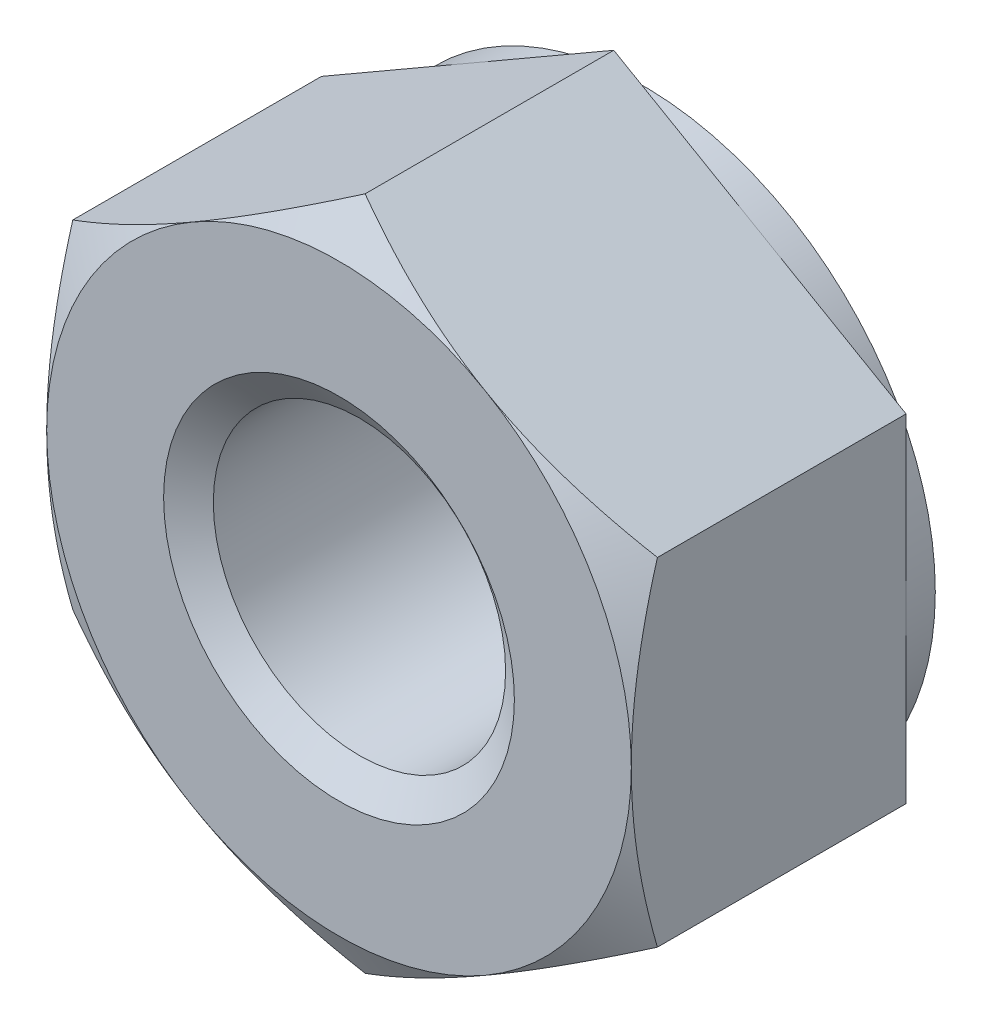
ISO-10303-21;
HEADER;
FILE_DESCRIPTION(('STEP AP214'),'2;1');
FILE_NAME('part.step','',(''),(''),'','','');
FILE_SCHEMA(('AUTOMOTIVE_DESIGN { 1 0 10303 214 1 1 1 1 }'));
ENDSEC;
DATA;
#1=APPLICATION_CONTEXT('core data for automotive mechanical design processes');
#2=APPLICATION_PROTOCOL_DEFINITION('international standard','automotive_design',2000,#1);
#3=PRODUCT_CONTEXT('',#1,'mechanical');
#4=PRODUCT('Part','Part','',(#3));
#5=PRODUCT_RELATED_PRODUCT_CATEGORY('part','',(#4));
#6=PRODUCT_DEFINITION_FORMATION('','',#4);
#7=PRODUCT_DEFINITION_CONTEXT('part definition',#1,'design');
#8=PRODUCT_DEFINITION('design','',#6,#7);
#9=PRODUCT_DEFINITION_SHAPE('','',#8);
#10=(LENGTH_UNIT() NAMED_UNIT(*) SI_UNIT(.MILLI.,.METRE.));
#11=(NAMED_UNIT(*) PLANE_ANGLE_UNIT() SI_UNIT($,.RADIAN.));
#12=(NAMED_UNIT(*) SI_UNIT($,.STERADIAN.) SOLID_ANGLE_UNIT());
#13=UNCERTAINTY_MEASURE_WITH_UNIT(LENGTH_MEASURE(1.E-05),#10,'distance_accuracy_value','');
#14=(GEOMETRIC_REPRESENTATION_CONTEXT(3) GLOBAL_UNCERTAINTY_ASSIGNED_CONTEXT((#13)) GLOBAL_UNIT_ASSIGNED_CONTEXT((#10,
#11,#12)) REPRESENTATION_CONTEXT('',''));
#15=CARTESIAN_POINT('',(0.,0.,0.));
#16=DIRECTION('',(0.,0.,1.));
#17=DIRECTION('',(1.,0.,0.));
#18=AXIS2_PLACEMENT_3D('',#15,#16,#17);
#19=CARTESIAN_POINT('',(0.,0.,-5.2));
#20=DIRECTION('',(0.,0.,1.));
#21=DIRECTION('',(1.,0.,0.));
#22=AXIS2_PLACEMENT_3D('',#19,#20,#21);
#23=CYLINDRICAL_SURFACE('',#22,2.5);
#24=CARTESIAN_POINT('',(0.,0.,-0.350103769104859));
#25=DIRECTION('',(0.,0.,1.));
#26=DIRECTION('',(1.,0.,0.));
#27=AXIS2_PLACEMENT_3D('',#24,#25,#26);
#28=CIRCLE('',#27,2.5);
#29=CARTESIAN_POINT('',(2.5,0.,-0.350103769104859));
#30=VERTEX_POINT('',#29);
#31=EDGE_CURVE('E153',#30,#30,#28,.F.);
#32=ORIENTED_EDGE('',*,*,#31,.F.);
#33=EDGE_LOOP('',(#32));
#34=FACE_BOUND('',#33,.T.);
#35=CARTESIAN_POINT('',(0.,0.,-4.82449623089514));
#36=DIRECTION('',(0.,0.,-1.));
#37=DIRECTION('',(-1.,0.,0.));
#38=AXIS2_PLACEMENT_3D('',#35,#36,#37);
#39=CIRCLE('',#38,2.5);
#40=CARTESIAN_POINT('',(-2.5,0.,-4.82449623089514));
#41=VERTEX_POINT('',#40);
#42=EDGE_CURVE('E41',#41,#41,#39,.F.);
#43=ORIENTED_EDGE('',*,*,#42,.F.);
#44=EDGE_LOOP('',(#43));
#45=FACE_BOUND('',#44,.T.);
#46=ADVANCED_FACE('F36',(#34,#45),#23,.F.);
#47=CARTESIAN_POINT('',(0.,5.77350269189626,-5.2));
#48=DIRECTION('',(-0.500000000000001,0.866025403784438,0.));
#49=DIRECTION('',(-0.866025403784438,-0.500000000000001,0.));
#50=AXIS2_PLACEMENT_3D('',#47,#48,#49);
#51=PLANE('',#50);
#52=DIRECTION('',(0.,0.,1.));
#53=VECTOR('',#52,1.);
#54=CARTESIAN_POINT('',(-5.,2.88675134594813,-5.2));
#55=LINE('',#54,#53);
#56=CARTESIAN_POINT('',(-5.,2.88675134594813,-4.7));
#57=VERTEX_POINT('',#56);
#58=CARTESIAN_POINT('',(-5.,2.88675134594813,-0.446581987385207));
#59=VERTEX_POINT('',#58);
#60=EDGE_CURVE('E291',#57,#59,#55,.T.);
#61=ORIENTED_EDGE('',*,*,#60,.T.);
#62=CARTESIAN_POINT('',(-5.0002,2.88663587589429,-0.44664865605183));
#63=CARTESIAN_POINT('',(-4.78046540547482,3.01349970319368,-0.373386567637636));
#64=CARTESIAN_POINT('',(-4.55885141554042,3.14144859993849,-0.306751321918093));
#65=CARTESIAN_POINT('',(-4.11178600454649,3.39956193532121,-0.190438991010811));
#66=CARTESIAN_POINT('',(-3.88632664040923,3.52973095989718,-0.140803049915789));
#67=CARTESIAN_POINT('',(-3.43816769477649,3.78847564779797,-0.0635510254186979));
#68=CARTESIAN_POINT('',(-3.21553790689581,3.91701101576052,-0.0354203782834897));
#69=CARTESIAN_POINT('',(-2.88081009815336,4.11026620624322,-0.0101949219536846));
#70=CARTESIAN_POINT('',(-2.76915780319494,4.17472868879311,-0.00461345976948387));
#71=CARTESIAN_POINT('',(-2.5457500293262,4.30371322717528,0.000797783248529765));
#72=CARTESIAN_POINT('',(-2.43399455370969,4.36823528110589,0.000627741741796264));
#73=CARTESIAN_POINT('',(-2.12781576914936,4.54500768479194,-0.00775363179203762));
#74=CARTESIAN_POINT('',(-1.93349391403279,4.65719946015293,-0.0218297718972529));
#75=CARTESIAN_POINT('',(-1.54613989800229,4.88083840557981,-0.0664652571094327));
#76=CARTESIAN_POINT('',(-1.35310909862843,4.99228478956021,-0.0970398601475102));
#77=CARTESIAN_POINT('',(-0.964974657525146,5.21637431361295,-0.173468493621167));
#78=CARTESIAN_POINT('',(-0.769920001358264,5.32898917185759,-0.219646378878684));
#79=CARTESIAN_POINT('',(-0.382719654641232,5.55253939626499,-0.324451794491939));
#80=CARTESIAN_POINT('',(-0.190569004591914,5.66347762579592,-0.383054703437379));
#81=CARTESIAN_POINT('',(0.000199999999999389,5.7736181619501,-0.446648656051834));
#82=B_SPLINE_CURVE_WITH_KNOTS('',3,(#62,#63,#64,#65,#66,#67,#68,#69,#70,#71,#72,#73,#74,#75,#76,
#77,#78,#79,#80,#81),.UNSPECIFIED.,.F.,.F.,(4,2,2,2,2,2,2,2,2,4),(0.,0.792555841363091,
1.58701660053334,2.36181537487281,2.74884076077326,3.13585419177295,3.8096236259968,
4.4840172390119,5.17336882348929,5.86136694793726),.UNSPECIFIED.);
#83=CARTESIAN_POINT('',(-2.50000000000001,4.33012701892219,0.));
#84=VERTEX_POINT('',#83);
#85=EDGE_CURVE('E139',#59,#84,#82,.T.);
#86=ORIENTED_EDGE('',*,*,#85,.T.);
#87=CARTESIAN_POINT('',(0.,5.77350269189626,-0.446581987385207));
#88=VERTEX_POINT('',#87);
#89=EDGE_CURVE('E166',#84,#88,#82,.T.);
#90=ORIENTED_EDGE('',*,*,#89,.T.);
#91=DIRECTION('',(0.,0.,1.));
#92=VECTOR('',#91,1.);
#93=CARTESIAN_POINT('',(0.,5.77350269189626,-5.2));
#94=LINE('',#93,#92);
#95=CARTESIAN_POINT('',(0.,5.77350269189626,-4.7));
#96=VERTEX_POINT('',#95);
#97=EDGE_CURVE('E279',#96,#88,#94,.T.);
#98=ORIENTED_EDGE('',*,*,#97,.F.);
#99=DIRECTION('',(-0.866025403784438,-0.500000000000001,0.));
#100=VECTOR('',#99,1.);
#101=CARTESIAN_POINT('',(0.,5.77350269189626,-4.7));
#102=LINE('',#101,#100);
#103=CARTESIAN_POINT('',(-2.50000000000001,4.33012701892219,-4.7));
#104=VERTEX_POINT('',#103);
#105=EDGE_CURVE('E267',#96,#104,#102,.T.);
#106=ORIENTED_EDGE('',*,*,#105,.T.);
#107=EDGE_CURVE('E263',#104,#57,#102,.T.);
#108=ORIENTED_EDGE('',*,*,#107,.T.);
#109=EDGE_LOOP('',(#61,#86,#90,#98,#106,#108));
#110=FACE_BOUND('',#109,.T.);
#111=ADVANCED_FACE('F38',(#110),#51,.T.);
#112=CARTESIAN_POINT('',(5.,2.88675134594812,-5.2));
#113=DIRECTION('',(0.500000000000001,0.866025403784438,0.));
#114=DIRECTION('',(-0.866025403784438,0.500000000000001,0.));
#115=AXIS2_PLACEMENT_3D('',#112,#113,#114);
#116=PLANE('',#115);
#117=ORIENTED_EDGE('',*,*,#97,.T.);
#118=CARTESIAN_POINT('',(-0.000200000000000168,5.7736181619501,-0.446648656051834));
#119=CARTESIAN_POINT('',(0.219534594525185,5.64675433465071,-0.373386567637639));
#120=CARTESIAN_POINT('',(0.44114858445958,5.5188054379059,-0.306751321918095));
#121=CARTESIAN_POINT('',(0.888213995453513,5.26069210252318,-0.190438991010813));
#122=CARTESIAN_POINT('',(1.11367335959077,5.13052307794721,-0.140803049915791));
#123=CARTESIAN_POINT('',(1.56183230522351,4.87177839004641,-0.0635510254186989));
#124=CARTESIAN_POINT('',(1.78446209310419,4.74324302208387,-0.03542037828349));
#125=CARTESIAN_POINT('',(2.11918990184664,4.54998783160116,-0.0101949219536847));
#126=CARTESIAN_POINT('',(2.23084219680506,4.48552534905128,-0.00461345976948397));
#127=CARTESIAN_POINT('',(2.4542499706738,4.35654081066911,0.000797783248529857));
#128=CARTESIAN_POINT('',(2.56600544629032,4.2920187567385,0.000627741741796628));
#129=CARTESIAN_POINT('',(2.87218423085064,4.11524635305244,-0.00775363179203654));
#130=CARTESIAN_POINT('',(3.06650608596722,4.00305457769146,-0.0218297718972514));
#131=CARTESIAN_POINT('',(3.45386010199771,3.77941563226457,-0.0664652571094306));
#132=CARTESIAN_POINT('',(3.64689090137157,3.66796924828418,-0.0970398601475081));
#133=CARTESIAN_POINT('',(4.03502534247485,3.44387972423143,-0.173468493621164));
#134=CARTESIAN_POINT('',(4.23007999864174,3.3312648659868,-0.21964637887868));
#135=CARTESIAN_POINT('',(4.61728034535877,3.1077146415794,-0.324451794491934));
#136=CARTESIAN_POINT('',(4.80943099540809,2.99677641204846,-0.383054703437375));
#137=CARTESIAN_POINT('',(5.0002,2.88663587589429,-0.446648656051829));
#138=B_SPLINE_CURVE_WITH_KNOTS('',3,(#118,#119,#120,#121,#122,#123,#124,#125,#126,#127,#128,
#129,#130,#131,#132,#133,#134,#135,#136,#137),.UNSPECIFIED.,.F.,.F.,(4,2,2,2,2,2,2,2,2,4),(0.,
0.792555841363093,1.58701660053334,2.36181537487281,2.74884076077326,3.13585419177296,
3.8096236259968,4.4840172390119,5.17336882348929,5.86136694793726),.UNSPECIFIED.);
#139=CARTESIAN_POINT('',(2.50000000000001,4.33012701892219,0.));
#140=VERTEX_POINT('',#139);
#141=EDGE_CURVE('E162',#88,#140,#138,.T.);
#142=ORIENTED_EDGE('',*,*,#141,.T.);
#143=CARTESIAN_POINT('',(5.,2.88675134594814,-0.446581987385207));
#144=VERTEX_POINT('',#143);
#145=EDGE_CURVE('E148',#140,#144,#138,.T.);
#146=ORIENTED_EDGE('',*,*,#145,.T.);
#147=DIRECTION('',(0.,0.,1.));
#148=VECTOR('',#147,1.);
#149=CARTESIAN_POINT('',(5.,2.88675134594812,-5.2));
#150=LINE('',#149,#148);
#151=CARTESIAN_POINT('',(5.,2.88675134594812,-4.7));
#152=VERTEX_POINT('',#151);
#153=EDGE_CURVE('E161',#152,#144,#150,.T.);
#154=ORIENTED_EDGE('',*,*,#153,.F.);
#155=DIRECTION('',(-0.866025403784438,0.500000000000001,0.));
#156=VECTOR('',#155,1.);
#157=CARTESIAN_POINT('',(5.,2.88675134594812,-4.7));
#158=LINE('',#157,#156);
#159=CARTESIAN_POINT('',(2.50000000000001,4.33012701892219,-4.7));
#160=VERTEX_POINT('',#159);
#161=EDGE_CURVE('E275',#152,#160,#158,.T.);
#162=ORIENTED_EDGE('',*,*,#161,.T.);
#163=EDGE_CURVE('E271',#160,#96,#158,.T.);
#164=ORIENTED_EDGE('',*,*,#163,.T.);
#165=EDGE_LOOP('',(#117,#142,#146,#154,#162,#164));
#166=FACE_BOUND('',#165,.T.);
#167=ADVANCED_FACE('F238',(#166),#116,.T.);
#168=CARTESIAN_POINT('',(5.,2.88675134594812,-5.2));
#169=DIRECTION('',(-1.,0.,0.));
#170=DIRECTION('',(0.,0.,1.));
#171=AXIS2_PLACEMENT_3D('',#168,#169,#170);
#172=PLANE('',#171);
#173=CARTESIAN_POINT('',(5.,-7.65608998744866,-2.3926335265508));
#174=CARTESIAN_POINT('',(5.,-7.43656171400167,-2.28654533817207));
#175=CARTESIAN_POINT('',(5.,-7.21651440170022,-2.18151175461596));
#176=CARTESIAN_POINT('',(5.,-6.77510105921519,-1.97415643363976));
#177=CARTESIAN_POINT('',(5.,-6.55373480873053,-1.87183516574569));
#178=CARTESIAN_POINT('',(5.,-6.10820714710357,-1.66996807853491));
#179=CARTESIAN_POINT('',(5.,-5.88403698971125,-1.57044149281731));
#180=CARTESIAN_POINT('',(5.,-5.43385418074678,-1.37566323278682));
#181=CARTESIAN_POINT('',(5.,-5.20784162594279,-1.28041133564243));
#182=CARTESIAN_POINT('',(5.,-4.75080884782756,-1.09418830918941));
#183=CARTESIAN_POINT('',(5.,-4.51976121099506,-1.0032840909987));
#184=CARTESIAN_POINT('',(5.,-4.054940534221,-0.828595302971951));
#185=CARTESIAN_POINT('',(5.,-3.82116719434025,-0.744811525247654));
#186=CARTESIAN_POINT('',(5.,-3.3510041671189,-0.586614632364621));
#187=CARTESIAN_POINT('',(5.,-3.11462125088188,-0.512181595225273));
#188=CARTESIAN_POINT('',(5.,-2.63849247870024,-0.375104393872379));
#189=CARTESIAN_POINT('',(5.,-2.39874771210331,-0.312456501596951));
#190=CARTESIAN_POINT('',(5.,-1.91574303714497,-0.20198775399487));
#191=CARTESIAN_POINT('',(5.,-1.672482210841,-0.154170846558643));
#192=CARTESIAN_POINT('',(5.,-1.18299359688664,-0.0765955557924034));
#193=CARTESIAN_POINT('',(5.,-0.936765806613286,-0.04683718842841));
#194=CARTESIAN_POINT('',(5.,-0.567032279323853,-0.0176512015862973));
#195=CARTESIAN_POINT('',(5.,-0.444105297658545,-0.0104963190599478));
#196=CARTESIAN_POINT('',(5.,-0.19805300523857,-0.00139545226904158));
#197=CARTESIAN_POINT('',(5.,-0.0749276970802335,0.000550599639613911));
#198=CARTESIAN_POINT('',(5.,0.171257999892349,-0.000818470345664297));
#199=CARTESIAN_POINT('',(5.,0.294318397227084,-0.00413211431301171));
#200=CARTESIAN_POINT('',(5.,0.540192730788836,-0.01593659728276));
#201=CARTESIAN_POINT('',(5.,0.663006654263479,-0.024427697570165));
#202=CARTESIAN_POINT('',(5.,0.960681872881663,-0.0511063802753008));
#203=CARTESIAN_POINT('',(5.,1.13531436279939,-0.071888967698286));
#204=CARTESIAN_POINT('',(5.,1.48321675799389,-0.122765655722695));
#205=CARTESIAN_POINT('',(5.,1.65648647841236,-0.152860997990034));
#206=CARTESIAN_POINT('',(5.,2.00155426058699,-0.221298792011551));
#207=CARTESIAN_POINT('',(5.,2.17335067370373,-0.259649477486404));
#208=CARTESIAN_POINT('',(5.,2.51518168221054,-0.343428305385011));
#209=CARTESIAN_POINT('',(5.,2.6852163841931,-0.388856016914001));
#210=CARTESIAN_POINT('',(5.,3.02770318928892,-0.486887782054292));
#211=CARTESIAN_POINT('',(5.,3.20011248435312,-0.539640363823941));
#212=CARTESIAN_POINT('',(5.,3.54310870430177,-0.650357787302625));
#213=CARTESIAN_POINT('',(5.,3.71369679659714,-0.708319033907069));
#214=CARTESIAN_POINT('',(5.,4.05236610267974,-0.828256540728473));
#215=CARTESIAN_POINT('',(5.,4.22045602230056,-0.890208365426364));
#216=CARTESIAN_POINT('',(5.,4.55533171687448,-1.01774823413812));
#217=CARTESIAN_POINT('',(5.,4.72211693321415,-1.08333774778777));
#218=CARTESIAN_POINT('',(5.,4.88829623733356,-1.15038625817724));
#219=B_SPLINE_CURVE_WITH_KNOTS('',3,(#173,#174,#175,#176,#177,#178,#179,#180,#181,#182,#183,
#184,#185,#186,#187,#188,#189,#190,#191,#192,#193,#194,#195,#196,#197,#198,#199,#200,#201,#202,
#203,#204,#205,#206,#207,#208,#209,#210,#211,#212,#213,#214,#215,#216,#217,#218),.UNSPECIFIED.,
.F.,.F.,(4,2,2,2,2,2,2,2,2,2,2,2,2,2,2,2,2,2,2,2,2,2,4),(0.,0.731464740665351,1.46305528824909,
2.19883243307486,2.93457117856034,3.67934251246858,4.42419659013361,5.1674358087199,
5.91043951739339,6.65364083834806,7.39684281638516,7.76615414335456,8.13546067426611,
8.50466345177856,8.87388486298453,9.40118542949727,9.92855633110015,10.4564556797854,
10.9843228991235,11.525120280828,12.065547221064,12.6029322754131,13.1405360390026),.UNSPECIFIED.);
#220=CARTESIAN_POINT('',(5.,-2.88675134594814,-0.446581987385207));
#221=VERTEX_POINT('',#220);
#222=CARTESIAN_POINT('',(5.,0.,0.));
#223=VERTEX_POINT('',#222);
#224=EDGE_CURVE('E128',#221,#223,#219,.T.);
#225=ORIENTED_EDGE('',*,*,#224,.F.);
#226=DIRECTION('',(0.,0.,1.));
#227=VECTOR('',#226,1.);
#228=CARTESIAN_POINT('',(5.,-2.88675134594814,-5.2));
#229=LINE('',#228,#227);
#230=CARTESIAN_POINT('',(5.,-2.88675134594814,-4.7));
#231=VERTEX_POINT('',#230);
#232=EDGE_CURVE('E284',#231,#221,#229,.T.);
#233=ORIENTED_EDGE('',*,*,#232,.F.);
#234=DIRECTION('',(0.,-1.,0.));
#235=VECTOR('',#234,1.);
#236=CARTESIAN_POINT('',(5.,2.88675134594812,-4.7));
#237=LINE('',#236,#235);
#238=CARTESIAN_POINT('',(5.,0.,-4.7));
#239=VERTEX_POINT('',#238);
#240=EDGE_CURVE('E276',#239,#231,#237,.T.);
#241=ORIENTED_EDGE('',*,*,#240,.F.);
#242=EDGE_CURVE('E278',#152,#239,#237,.T.);
#243=ORIENTED_EDGE('',*,*,#242,.F.);
#244=ORIENTED_EDGE('',*,*,#153,.T.);
#245=EDGE_CURVE('E141',#223,#144,#219,.T.);
#246=ORIENTED_EDGE('',*,*,#245,.F.);
#247=EDGE_LOOP('',(#225,#233,#241,#243,#244,#246));
#248=FACE_BOUND('',#247,.T.);
#249=ADVANCED_FACE('F158',(#248),#172,.F.);
#250=CARTESIAN_POINT('',(0.,-5.77350269189628,-5.2));
#251=DIRECTION('',(0.500000000000001,-0.866025403784438,0.));
#252=DIRECTION('',(0.866025403784438,0.500000000000001,0.));
#253=AXIS2_PLACEMENT_3D('',#250,#251,#252);
#254=PLANE('',#253);
#255=ORIENTED_EDGE('',*,*,#232,.T.);
#256=CARTESIAN_POINT('',(5.0002,-2.8866358758943,-0.446648656051834));
#257=CARTESIAN_POINT('',(4.78046540547481,-3.01349970319369,-0.37338656763764));
#258=CARTESIAN_POINT('',(4.55885141554042,-3.1414485999385,-0.306751321918097));
#259=CARTESIAN_POINT('',(4.11178600454649,-3.39956193532122,-0.190438991010816));
#260=CARTESIAN_POINT('',(3.88632664040922,-3.52973095989719,-0.140803049915794));
#261=CARTESIAN_POINT('',(3.43816769477649,-3.78847564779799,-0.0635510254187034));
#262=CARTESIAN_POINT('',(3.2155379068958,-3.91701101576053,-0.0354203782834953));
#263=CARTESIAN_POINT('',(2.88081009815336,-4.11026620624324,-0.0101949219536911));
#264=CARTESIAN_POINT('',(2.76915780319494,-4.17472868879312,-0.00461345976949075));
#265=CARTESIAN_POINT('',(2.5457500293262,-4.30371322717529,0.000797783248522375));
#266=CARTESIAN_POINT('',(2.43399455370968,-4.3682352811059,0.000627741741788817));
#267=CARTESIAN_POINT('',(2.12781576914936,-4.54500768479196,-0.00775363179204525));
#268=CARTESIAN_POINT('',(1.93349391403278,-4.65719946015294,-0.0218297718972606));
#269=CARTESIAN_POINT('',(1.54613989800229,-4.88083840557983,-0.0664652571094406));
#270=CARTESIAN_POINT('',(1.35310909862843,-4.99228478956022,-0.0970398601475181));
#271=CARTESIAN_POINT('',(0.964974657525144,-5.21637431361297,-0.173468493621175));
#272=CARTESIAN_POINT('',(0.769920001358263,-5.3289891718576,-0.219646378878692));
#273=CARTESIAN_POINT('',(0.38271965464123,-5.552539396265,-0.324451794491947));
#274=CARTESIAN_POINT('',(0.190569004591912,-5.66347762579594,-0.383054703437388));
#275=CARTESIAN_POINT('',(-0.000200000000000516,-5.77361816195011,-0.446648656051842));
#276=B_SPLINE_CURVE_WITH_KNOTS('',3,(#256,#257,#258,#259,#260,#261,#262,#263,#264,#265,#266,
#267,#268,#269,#270,#271,#272,#273,#274,#275),.UNSPECIFIED.,.F.,.F.,(4,2,2,2,2,2,2,2,2,4),(0.,
0.792555841363092,1.58701660053334,2.36181537487281,2.74884076077326,3.13585419177295,
3.8096236259968,4.4840172390119,5.17336882348929,5.86136694793726),.UNSPECIFIED.);
#277=CARTESIAN_POINT('',(2.50000000000001,-4.33012701892219,0.));
#278=VERTEX_POINT('',#277);
#279=EDGE_CURVE('E134',#221,#278,#276,.T.);
#280=ORIENTED_EDGE('',*,*,#279,.T.);
#281=CARTESIAN_POINT('',(0.,-5.77350269189626,-0.446581987385207));
#282=VERTEX_POINT('',#281);
#283=EDGE_CURVE('E55',#278,#282,#276,.T.);
#284=ORIENTED_EDGE('',*,*,#283,.T.);
#285=DIRECTION('',(0.,0.,1.));
#286=VECTOR('',#285,1.);
#287=CARTESIAN_POINT('',(0.,-5.77350269189628,-5.2));
#288=LINE('',#287,#286);
#289=CARTESIAN_POINT('',(0.,-5.77350269189628,-4.7));
#290=VERTEX_POINT('',#289);
#291=EDGE_CURVE('E286',#290,#282,#288,.T.);
#292=ORIENTED_EDGE('',*,*,#291,.F.);
#293=DIRECTION('',(0.866025403784438,0.500000000000001,0.));
#294=VECTOR('',#293,1.);
#295=CARTESIAN_POINT('',(0.,-5.77350269189628,-4.7));
#296=LINE('',#295,#294);
#297=CARTESIAN_POINT('',(2.50000000000001,-4.3301270189222,-4.7));
#298=VERTEX_POINT('',#297);
#299=EDGE_CURVE('E268',#290,#298,#296,.T.);
#300=ORIENTED_EDGE('',*,*,#299,.T.);
#301=EDGE_CURVE('E272',#298,#231,#296,.T.);
#302=ORIENTED_EDGE('',*,*,#301,.T.);
#303=EDGE_LOOP('',(#255,#280,#284,#292,#300,#302));
#304=FACE_BOUND('',#303,.T.);
#305=ADVANCED_FACE('F219',(#304),#254,.T.);
#306=CARTESIAN_POINT('',(-5.,-2.88675134594814,-5.2));
#307=DIRECTION('',(-0.500000000000001,-0.866025403784438,0.));
#308=DIRECTION('',(0.866025403784438,-0.500000000000001,0.));
#309=AXIS2_PLACEMENT_3D('',#306,#307,#308);
#310=PLANE('',#309);
#311=ORIENTED_EDGE('',*,*,#291,.T.);
#312=CARTESIAN_POINT('',(0.00019999999999915,-5.77361816195011,-0.446648656051842));
#313=CARTESIAN_POINT('',(-0.219534594525186,-5.64675433465073,-0.373386567637647));
#314=CARTESIAN_POINT('',(-0.441148584459582,-5.51880543790591,-0.306751321918103));
#315=CARTESIAN_POINT('',(-0.888213995453517,-5.26069210252319,-0.190438991010821));
#316=CARTESIAN_POINT('',(-1.11367335959078,-5.13052307794722,-0.140803049915798));
#317=CARTESIAN_POINT('',(-1.56183230522351,-4.87177839004642,-0.0635510254187064));
#318=CARTESIAN_POINT('',(-1.7844620931042,-4.74324302208388,-0.0354203782834974));
#319=CARTESIAN_POINT('',(-2.11918990184665,-4.54998783160117,-0.010194921953692));
#320=CARTESIAN_POINT('',(-2.23084219680507,-4.48552534905129,-0.00461345976949137));
#321=CARTESIAN_POINT('',(-2.45424997067381,-4.35654081066912,0.000797783248522737));
#322=CARTESIAN_POINT('',(-2.56600544629032,-4.29201875673851,0.0006277417417898));
#323=CARTESIAN_POINT('',(-2.87218423085065,-4.11524635305245,-0.00775363179204314));
#324=CARTESIAN_POINT('',(-3.06650608596722,-4.00305457769147,-0.0218297718972584));
#325=CARTESIAN_POINT('',(-3.45386010199771,-3.77941563226458,-0.0664652571094375));
#326=CARTESIAN_POINT('',(-3.64689090137158,-3.66796924828419,-0.0970398601475144));
#327=CARTESIAN_POINT('',(-4.03502534247486,-3.44387972423145,-0.173468493621169));
#328=CARTESIAN_POINT('',(-4.23007999864174,-3.33126486598681,-0.219646378878686));
#329=CARTESIAN_POINT('',(-4.61728034535877,-3.10771464157941,-0.324451794491939));
#330=CARTESIAN_POINT('',(-4.80943099540809,-2.99677641204848,-0.383054703437379));
#331=CARTESIAN_POINT('',(-5.0002,-2.8866358758943,-0.446648656051833));
#332=B_SPLINE_CURVE_WITH_KNOTS('',3,(#312,#313,#314,#315,#316,#317,#318,#319,#320,#321,#322,
#323,#324,#325,#326,#327,#328,#329,#330,#331),.UNSPECIFIED.,.F.,.F.,(4,2,2,2,2,2,2,2,2,4),(0.,
0.792555841363094,1.58701660053334,2.36181537487281,2.74884076077326,3.13585419177296,
3.8096236259968,4.4840172390119,5.17336882348929,5.86136694793726),.UNSPECIFIED.);
#333=CARTESIAN_POINT('',(-2.50000000000001,-4.33012701892219,0.));
#334=VERTEX_POINT('',#333);
#335=EDGE_CURVE('E213',#282,#334,#332,.T.);
#336=ORIENTED_EDGE('',*,*,#335,.T.);
#337=CARTESIAN_POINT('',(-5.,-2.88675134594814,-0.446581987385207));
#338=VERTEX_POINT('',#337);
#339=EDGE_CURVE('E62',#334,#338,#332,.T.);
#340=ORIENTED_EDGE('',*,*,#339,.T.);
#341=DIRECTION('',(0.,0.,1.));
#342=VECTOR('',#341,1.);
#343=CARTESIAN_POINT('',(-5.,-2.88675134594814,-5.2));
#344=LINE('',#343,#342);
#345=CARTESIAN_POINT('',(-5.,-2.88675134594814,-4.7));
#346=VERTEX_POINT('',#345);
#347=EDGE_CURVE('E289',#346,#338,#344,.T.);
#348=ORIENTED_EDGE('',*,*,#347,.F.);
#349=DIRECTION('',(0.866025403784438,-0.500000000000001,0.));
#350=VECTOR('',#349,1.);
#351=CARTESIAN_POINT('',(-5.,-2.88675134594814,-4.7));
#352=LINE('',#351,#350);
#353=CARTESIAN_POINT('',(-2.50000000000001,-4.3301270189222,-4.7));
#354=VERTEX_POINT('',#353);
#355=EDGE_CURVE('E258',#346,#354,#352,.T.);
#356=ORIENTED_EDGE('',*,*,#355,.T.);
#357=EDGE_CURVE('E264',#354,#290,#352,.T.);
#358=ORIENTED_EDGE('',*,*,#357,.T.);
#359=EDGE_LOOP('',(#311,#336,#340,#348,#356,#358));
#360=FACE_BOUND('',#359,.T.);
#361=ADVANCED_FACE('F215',(#360),#310,.T.);
#362=CARTESIAN_POINT('',(-5.,2.88675134594813,-5.2));
#363=DIRECTION('',(-1.,0.,0.));
#364=DIRECTION('',(0.,0.,1.));
#365=AXIS2_PLACEMENT_3D('',#362,#363,#364);
#366=PLANE('',#365);
#367=ORIENTED_EDGE('',*,*,#347,.T.);
#368=CARTESIAN_POINT('',(-5.,-7.65608998744865,-2.3926335265508));
#369=CARTESIAN_POINT('',(-5.,-7.43656171400167,-2.28654533817207));
#370=CARTESIAN_POINT('',(-5.,-7.21651440170022,-2.18151175461596));
#371=CARTESIAN_POINT('',(-5.,-6.77510105921519,-1.97415643363976));
#372=CARTESIAN_POINT('',(-5.,-6.55373480873053,-1.87183516574569));
#373=CARTESIAN_POINT('',(-5.,-6.10820714710357,-1.66996807853491));
#374=CARTESIAN_POINT('',(-5.,-5.88403698971125,-1.57044149281731));
#375=CARTESIAN_POINT('',(-5.,-5.43385418074678,-1.37566323278682));
#376=CARTESIAN_POINT('',(-5.,-5.20784162594279,-1.28041133564243));
#377=CARTESIAN_POINT('',(-5.,-4.75080884782756,-1.09418830918941));
#378=CARTESIAN_POINT('',(-5.,-4.51976121099506,-1.0032840909987));
#379=CARTESIAN_POINT('',(-5.,-4.054940534221,-0.828595302971951));
#380=CARTESIAN_POINT('',(-5.,-3.82116719434025,-0.744811525247654));
#381=CARTESIAN_POINT('',(-5.,-3.35100416711889,-0.586614632364621));
#382=CARTESIAN_POINT('',(-5.,-3.11462125088188,-0.512181595225273));
#383=CARTESIAN_POINT('',(-5.,-2.63849247870024,-0.375104393872378));
#384=CARTESIAN_POINT('',(-5.,-2.39874771210331,-0.312456501596951));
#385=CARTESIAN_POINT('',(-5.,-1.91574303714497,-0.20198775399487));
#386=CARTESIAN_POINT('',(-5.,-1.672482210841,-0.154170846558642));
#387=CARTESIAN_POINT('',(-5.,-1.18299359688664,-0.0765955557924031));
#388=CARTESIAN_POINT('',(-5.,-0.936765806613284,-0.0468371884284103));
#389=CARTESIAN_POINT('',(-5.,-0.56703227932385,-0.0176512015862971));
#390=CARTESIAN_POINT('',(-5.,-0.444105297658542,-0.0104963190599473));
#391=CARTESIAN_POINT('',(-5.,-0.198053005238567,-0.00139545226904109));
#392=CARTESIAN_POINT('',(-5.,-0.0749276970802306,0.00055059963961404));
#393=CARTESIAN_POINT('',(-5.,0.171257999892351,-0.000818470345664426));
#394=CARTESIAN_POINT('',(-5.,0.294318397227087,-0.00413211431301173));
#395=CARTESIAN_POINT('',(-5.,0.540192730788839,-0.01593659728276));
#396=CARTESIAN_POINT('',(-5.,0.663006654263481,-0.024427697570165));
#397=CARTESIAN_POINT('',(-5.,0.960681872881665,-0.051106380275301));
#398=CARTESIAN_POINT('',(-5.,1.1353143627994,-0.0718889676982864));
#399=CARTESIAN_POINT('',(-5.,1.48321675799389,-0.122765655722695));
#400=CARTESIAN_POINT('',(-5.,1.65648647841236,-0.152860997990034));
#401=CARTESIAN_POINT('',(-5.,2.00155426058699,-0.221298792011551));
#402=CARTESIAN_POINT('',(-5.,2.17335067370373,-0.259649477486405));
#403=CARTESIAN_POINT('',(-5.,2.51518168221054,-0.343428305385011));
#404=CARTESIAN_POINT('',(-5.,2.68521638419311,-0.388856016914002));
#405=CARTESIAN_POINT('',(-5.,3.02770318928892,-0.486887782054293));
#406=CARTESIAN_POINT('',(-5.,3.20011248435312,-0.539640363823943));
#407=CARTESIAN_POINT('',(-5.,3.54310870430177,-0.650357787302627));
#408=CARTESIAN_POINT('',(-5.,3.71369679659715,-0.70831903390707));
#409=CARTESIAN_POINT('',(-5.,4.05236610267974,-0.828256540728474));
#410=CARTESIAN_POINT('',(-5.,4.22045602230056,-0.890208365426365));
#411=CARTESIAN_POINT('',(-5.,4.55533171687449,-1.01774823413812));
#412=CARTESIAN_POINT('',(-5.,4.72211693321415,-1.08333774778777));
#413=CARTESIAN_POINT('',(-5.,4.88829623733356,-1.15038625817724));
#414=B_SPLINE_CURVE_WITH_KNOTS('',3,(#368,#369,#370,#371,#372,#373,#374,#375,#376,#377,#378,
#379,#380,#381,#382,#383,#384,#385,#386,#387,#388,#389,#390,#391,#392,#393,#394,#395,#396,#397,
#398,#399,#400,#401,#402,#403,#404,#405,#406,#407,#408,#409,#410,#411,#412,#413),.UNSPECIFIED.,
.F.,.F.,(4,2,2,2,2,2,2,2,2,2,2,2,2,2,2,2,2,2,2,2,2,2,4),(0.,0.731464740665351,1.46305528824908,
2.19883243307486,2.93457117856033,3.67934251246858,4.42419659013361,5.16743580871989,
5.91043951739339,6.65364083834806,7.39684281638516,7.76615414335457,8.13546067426611,
8.50466345177856,8.87388486298453,9.40118542949727,9.92855633110016,10.4564556797854,
10.9843228991235,11.525120280828,12.065547221064,12.6029322754131,13.1405360390026),.UNSPECIFIED.);
#415=CARTESIAN_POINT('',(-5.,0.,0.));
#416=VERTEX_POINT('',#415);
#417=EDGE_CURVE('E214',#338,#416,#414,.T.);
#418=ORIENTED_EDGE('',*,*,#417,.T.);
#419=EDGE_CURVE('E152',#416,#59,#414,.T.);
#420=ORIENTED_EDGE('',*,*,#419,.T.);
#421=ORIENTED_EDGE('',*,*,#60,.F.);
#422=DIRECTION('',(0.,-1.,0.));
#423=VECTOR('',#422,1.);
#424=CARTESIAN_POINT('',(-5.,2.88675134594813,-4.7));
#425=LINE('',#424,#423);
#426=CARTESIAN_POINT('',(-5.,0.,-4.7));
#427=VERTEX_POINT('',#426);
#428=EDGE_CURVE('E298',#57,#427,#425,.T.);
#429=ORIENTED_EDGE('',*,*,#428,.T.);
#430=EDGE_CURVE('E296',#427,#346,#425,.T.);
#431=ORIENTED_EDGE('',*,*,#430,.T.);
#432=EDGE_LOOP('',(#367,#418,#420,#421,#429,#431));
#433=FACE_BOUND('',#432,.T.);
#434=ADVANCED_FACE('F218',(#433),#366,.T.);
#435=CARTESIAN_POINT('',(-9.99999999999999,0.,0.));
#436=DIRECTION('',(0.,0.,1.));
#437=DIRECTION('',(1.,0.,0.));
#438=AXIS2_PLACEMENT_3D('',#435,#436,#437);
#439=PLANE('',#438);
#440=CARTESIAN_POINT('',(0.,0.,0.));
#441=DIRECTION('',(0.,0.,1.));
#442=DIRECTION('',(1.,0.,0.));
#443=AXIS2_PLACEMENT_3D('',#440,#441,#442);
#444=CIRCLE('',#443,3.);
#445=CARTESIAN_POINT('',(3.,0.,0.));
#446=VERTEX_POINT('',#445);
#447=EDGE_CURVE('E301',#446,#446,#444,.T.);
#448=ORIENTED_EDGE('',*,*,#447,.F.);
#449=EDGE_LOOP('',(#448));
#450=FACE_BOUND('',#449,.T.);
#451=CARTESIAN_POINT('',(0.,0.,0.));
#452=DIRECTION('',(0.,0.,1.));
#453=DIRECTION('',(1.,0.,0.));
#454=AXIS2_PLACEMENT_3D('',#451,#452,#453);
#455=CIRCLE('',#454,5.);
#456=EDGE_CURVE('E12',#223,#278,#455,.F.);
#457=ORIENTED_EDGE('',*,*,#456,.F.);
#458=CARTESIAN_POINT('',(0.,0.,0.));
#459=DIRECTION('',(0.,0.,1.));
#460=DIRECTION('',(1.,0.,0.));
#461=AXIS2_PLACEMENT_3D('',#458,#459,#460);
#462=CIRCLE('',#461,5.);
#463=EDGE_CURVE('E145',#223,#140,#462,.T.);
#464=ORIENTED_EDGE('',*,*,#463,.T.);
#465=EDGE_CURVE('E48',#84,#140,#455,.F.);
#466=ORIENTED_EDGE('',*,*,#465,.F.);
#467=EDGE_CURVE('E366',#416,#84,#455,.F.);
#468=ORIENTED_EDGE('',*,*,#467,.F.);
#469=EDGE_CURVE('E368',#334,#416,#455,.F.);
#470=ORIENTED_EDGE('',*,*,#469,.F.);
#471=EDGE_CURVE('E46',#278,#334,#455,.F.);
#472=ORIENTED_EDGE('',*,*,#471,.F.);
#473=EDGE_LOOP('',(#457,#464,#466,#468,#470,#472));
#474=FACE_BOUND('',#473,.T.);
#475=ADVANCED_FACE('F155',(#450,#474),#439,.T.);
#476=CARTESIAN_POINT('',(-9.99999999999999,0.,-5.2));
#477=DIRECTION('',(0.,0.,1.));
#478=DIRECTION('',(1.,0.,0.));
#479=AXIS2_PLACEMENT_3D('',#476,#477,#478);
#480=PLANE('',#479);
#481=CARTESIAN_POINT('',(0.,0.,-5.2));
#482=DIRECTION('',(0.,0.,1.));
#483=DIRECTION('',(1.,0.,0.));
#484=AXIS2_PLACEMENT_3D('',#481,#482,#483);
#485=CIRCLE('',#484,3.);
#486=CARTESIAN_POINT('',(3.,0.,-5.2));
#487=VERTEX_POINT('',#486);
#488=EDGE_CURVE('E302',#487,#487,#485,.F.);
#489=ORIENTED_EDGE('',*,*,#488,.F.);
#490=EDGE_LOOP('',(#489));
#491=FACE_BOUND('',#490,.T.);
#492=CARTESIAN_POINT('',(0.,0.,-5.2));
#493=DIRECTION('',(0.,0.,1.));
#494=DIRECTION('',(1.,0.,0.));
#495=AXIS2_PLACEMENT_3D('',#492,#493,#494);
#496=CIRCLE('',#495,5.);
#497=CARTESIAN_POINT('',(5.,0.,-5.2));
#498=VERTEX_POINT('',#497);
#499=EDGE_CURVE('E282',#498,#498,#496,.F.);
#500=ORIENTED_EDGE('',*,*,#499,.T.);
#501=EDGE_LOOP('',(#500));
#502=FACE_BOUND('',#501,.T.);
#503=ADVANCED_FACE('F228',(#491,#502),#480,.F.);
#504=CARTESIAN_POINT('',(0.,15.7735026918963,-4.7));
#505=DIRECTION('',(0.,0.,-1.));
#506=DIRECTION('',(-1.,0.,0.));
#507=AXIS2_PLACEMENT_3D('',#504,#505,#506);
#508=PLANE('',#507);
#509=ORIENTED_EDGE('',*,*,#242,.T.);
#510=CARTESIAN_POINT('',(0.,0.,-4.7));
#511=DIRECTION('',(0.,0.,1.));
#512=DIRECTION('',(1.,0.,0.));
#513=AXIS2_PLACEMENT_3D('',#510,#511,#512);
#514=CIRCLE('',#513,5.);
#515=EDGE_CURVE('E255',#239,#160,#514,.T.);
#516=ORIENTED_EDGE('',*,*,#515,.T.);
#517=ORIENTED_EDGE('',*,*,#161,.F.);
#518=EDGE_LOOP('',(#509,#516,#517));
#519=FACE_BOUND('',#518,.T.);
#520=ADVANCED_FACE('F245',(#519),#508,.T.);
#521=ORIENTED_EDGE('',*,*,#240,.T.);
#522=ORIENTED_EDGE('',*,*,#301,.F.);
#523=EDGE_CURVE('E260',#298,#239,#514,.T.);
#524=ORIENTED_EDGE('',*,*,#523,.T.);
#525=EDGE_LOOP('',(#521,#522,#524));
#526=FACE_BOUND('',#525,.T.);
#527=ADVANCED_FACE('F344',(#526),#508,.T.);
#528=EDGE_CURVE('E259',#160,#104,#514,.T.);
#529=ORIENTED_EDGE('',*,*,#528,.T.);
#530=ORIENTED_EDGE('',*,*,#105,.F.);
#531=ORIENTED_EDGE('',*,*,#163,.F.);
#532=EDGE_LOOP('',(#529,#530,#531));
#533=FACE_BOUND('',#532,.T.);
#534=ADVANCED_FACE('F352',(#533),#508,.T.);
#535=ORIENTED_EDGE('',*,*,#357,.F.);
#536=EDGE_CURVE('E383',#354,#298,#514,.T.);
#537=ORIENTED_EDGE('',*,*,#536,.T.);
#538=ORIENTED_EDGE('',*,*,#299,.F.);
#539=EDGE_LOOP('',(#535,#537,#538));
#540=FACE_BOUND('',#539,.T.);
#541=ADVANCED_FACE('F347',(#540),#508,.T.);
#542=EDGE_CURVE('E356',#104,#427,#514,.T.);
#543=ORIENTED_EDGE('',*,*,#542,.T.);
#544=ORIENTED_EDGE('',*,*,#428,.F.);
#545=ORIENTED_EDGE('',*,*,#107,.F.);
#546=EDGE_LOOP('',(#543,#544,#545));
#547=FACE_BOUND('',#546,.T.);
#548=ADVANCED_FACE('F338',(#547),#508,.T.);
#549=CARTESIAN_POINT('',(0.,0.,0.));
#550=DIRECTION('',(0.,0.,1.));
#551=DIRECTION('',(1.,0.,0.));
#552=AXIS2_PLACEMENT_3D('',#549,#550,#551);
#553=CYLINDRICAL_SURFACE('',#552,5.);
#554=ORIENTED_EDGE('',*,*,#499,.F.);
#555=EDGE_LOOP('',(#554));
#556=FACE_BOUND('',#555,.T.);
#557=ORIENTED_EDGE('',*,*,#528,.F.);
#558=ORIENTED_EDGE('',*,*,#515,.F.);
#559=ORIENTED_EDGE('',*,*,#523,.F.);
#560=ORIENTED_EDGE('',*,*,#536,.F.);
#561=EDGE_CURVE('E362',#427,#354,#514,.T.);
#562=ORIENTED_EDGE('',*,*,#561,.F.);
#563=ORIENTED_EDGE('',*,*,#542,.F.);
#564=EDGE_LOOP('',(#557,#558,#559,#560,#562,#563));
#565=FACE_BOUND('',#564,.T.);
#566=ADVANCED_FACE('F243',(#556,#565),#553,.T.);
#567=ORIENTED_EDGE('',*,*,#430,.F.);
#568=ORIENTED_EDGE('',*,*,#561,.T.);
#569=ORIENTED_EDGE('',*,*,#355,.F.);
#570=EDGE_LOOP('',(#567,#568,#569));
#571=FACE_BOUND('',#570,.T.);
#572=ADVANCED_FACE('F196',(#571),#508,.T.);
#573=CARTESIAN_POINT('',(0.,0.,0.));
#574=DIRECTION('',(0.,0.,-1.));
#575=DIRECTION('',(-1.,0.,0.));
#576=AXIS2_PLACEMENT_3D('',#573,#574,#575);
#577=CONICAL_SURFACE('',#576,5.,1.0471975511966);
#578=ORIENTED_EDGE('',*,*,#463,.F.);
#579=ORIENTED_EDGE('',*,*,#245,.T.);
#580=ORIENTED_EDGE('',*,*,#145,.F.);
#581=EDGE_LOOP('',(#578,#579,#580));
#582=FACE_BOUND('',#581,.T.);
#583=ADVANCED_FACE('F146',(#582),#577,.T.);
#584=ORIENTED_EDGE('',*,*,#465,.T.);
#585=ORIENTED_EDGE('',*,*,#141,.F.);
#586=ORIENTED_EDGE('',*,*,#89,.F.);
#587=EDGE_LOOP('',(#584,#585,#586));
#588=FACE_BOUND('',#587,.T.);
#589=ADVANCED_FACE('F193',(#588),#577,.T.);
#590=ORIENTED_EDGE('',*,*,#419,.F.);
#591=ORIENTED_EDGE('',*,*,#467,.T.);
#592=ORIENTED_EDGE('',*,*,#85,.F.);
#593=EDGE_LOOP('',(#590,#591,#592));
#594=FACE_BOUND('',#593,.T.);
#595=ADVANCED_FACE('F192',(#594),#577,.T.);
#596=ORIENTED_EDGE('',*,*,#469,.T.);
#597=ORIENTED_EDGE('',*,*,#417,.F.);
#598=ORIENTED_EDGE('',*,*,#339,.F.);
#599=EDGE_LOOP('',(#596,#597,#598));
#600=FACE_BOUND('',#599,.T.);
#601=ADVANCED_FACE('F186',(#600),#577,.T.);
#602=ORIENTED_EDGE('',*,*,#471,.T.);
#603=ORIENTED_EDGE('',*,*,#335,.F.);
#604=ORIENTED_EDGE('',*,*,#283,.F.);
#605=EDGE_LOOP('',(#602,#603,#604));
#606=FACE_BOUND('',#605,.T.);
#607=ADVANCED_FACE('F191',(#606),#577,.T.);
#608=ORIENTED_EDGE('',*,*,#224,.T.);
#609=ORIENTED_EDGE('',*,*,#456,.T.);
#610=ORIENTED_EDGE('',*,*,#279,.F.);
#611=EDGE_LOOP('',(#608,#609,#610));
#612=FACE_BOUND('',#611,.T.);
#613=ADVANCED_FACE('F130',(#612),#577,.T.);
#614=CARTESIAN_POINT('',(0.,0.,-0.385114146015345));
#615=DIRECTION('',(0.,0.,1.));
#616=DIRECTION('',(1.,0.,0.));
#617=AXIS2_PLACEMENT_3D('',#614,#615,#616);
#618=CONICAL_SURFACE('',#617,2.45,0.959931088596876);
#619=ORIENTED_EDGE('',*,*,#447,.T.);
#620=EDGE_LOOP('',(#619));
#621=FACE_BOUND('',#620,.T.);
#622=ORIENTED_EDGE('',*,*,#31,.T.);
#623=EDGE_LOOP('',(#622));
#624=FACE_BOUND('',#623,.T.);
#625=ADVANCED_FACE('F194',(#621,#624),#618,.F.);
#626=CARTESIAN_POINT('',(0.,0.,-5.1746));
#627=DIRECTION('',(0.,0.,-1.));
#628=DIRECTION('',(-1.,0.,0.));
#629=AXIS2_PLACEMENT_3D('',#626,#627,#628);
#630=CONICAL_SURFACE('',#629,3.,0.95993108859688);
#631=CARTESIAN_POINT('',(0.,0.,-5.1746));
#632=DIRECTION('',(0.,0.,1.));
#633=DIRECTION('',(1.,0.,0.));
#634=AXIS2_PLACEMENT_3D('',#631,#632,#633);
#635=CIRCLE('',#634,3.);
#636=CARTESIAN_POINT('',(3.,0.,-5.1746));
#637=VERTEX_POINT('',#636);
#638=EDGE_CURVE('E304',#637,#637,#635,.T.);
#639=ORIENTED_EDGE('',*,*,#638,.F.);
#640=EDGE_LOOP('',(#639));
#641=FACE_BOUND('',#640,.T.);
#642=ORIENTED_EDGE('',*,*,#42,.T.);
#643=EDGE_LOOP('',(#642));
#644=FACE_BOUND('',#643,.T.);
#645=ADVANCED_FACE('F318',(#641,#644),#630,.F.);
#646=CARTESIAN_POINT('',(0.,0.,-25.0375057290932));
#647=DIRECTION('',(0.,0.,1.));
#648=DIRECTION('',(1.,0.,0.));
#649=AXIS2_PLACEMENT_3D('',#646,#647,#648);
#650=CYLINDRICAL_SURFACE('',#649,3.);
#651=ORIENTED_EDGE('',*,*,#638,.T.);
#652=EDGE_LOOP('',(#651));
#653=FACE_BOUND('',#652,.T.);
#654=ORIENTED_EDGE('',*,*,#488,.T.);
#655=EDGE_LOOP('',(#654));
#656=FACE_BOUND('',#655,.T.);
#657=ADVANCED_FACE('F323',(#653,#656),#650,.F.);
#658=CLOSED_SHELL('',(#46,#111,#167,#249,#305,#361,#434,#475,#503,#520,#527,#534,#541,#548,#566,
#572,#583,#589,#595,#601,#607,#613,#625,#645,#657));
#659=MANIFOLD_SOLID_BREP('B2',#658);
#660=ADVANCED_BREP_SHAPE_REPRESENTATION('',(#18,#659),#14);
#661=SHAPE_DEFINITION_REPRESENTATION(#9,#660);
ENDSEC;
END-ISO-10303-21;
